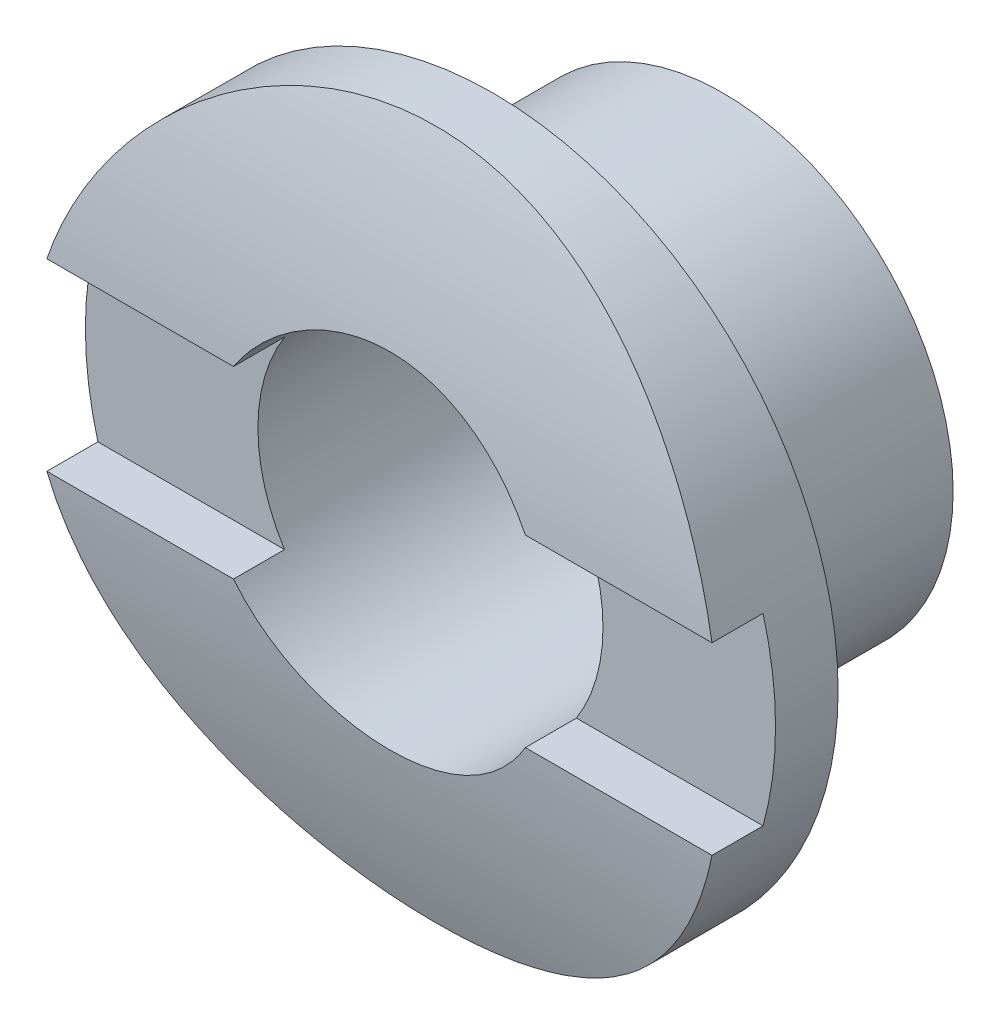
ISO-10303-21;
HEADER;
FILE_DESCRIPTION(('STEP AP214'),'2;1');
FILE_NAME('part.step','',(''),(''),'','','');
FILE_SCHEMA(('AUTOMOTIVE_DESIGN { 1 0 10303 214 1 1 1 1 }'));
ENDSEC;
DATA;
#1=APPLICATION_CONTEXT('core data for automotive mechanical design processes');
#2=APPLICATION_PROTOCOL_DEFINITION('international standard','automotive_design',2000,#1);
#3=PRODUCT_CONTEXT('',#1,'mechanical');
#4=PRODUCT('Part','Part','',(#3));
#5=PRODUCT_RELATED_PRODUCT_CATEGORY('part','',(#4));
#6=PRODUCT_DEFINITION_FORMATION('','',#4);
#7=PRODUCT_DEFINITION_CONTEXT('part definition',#1,'design');
#8=PRODUCT_DEFINITION('design','',#6,#7);
#9=PRODUCT_DEFINITION_SHAPE('','',#8);
#10=(LENGTH_UNIT() NAMED_UNIT(*) SI_UNIT(.MILLI.,.METRE.));
#11=(NAMED_UNIT(*) PLANE_ANGLE_UNIT() SI_UNIT($,.RADIAN.));
#12=(NAMED_UNIT(*) SI_UNIT($,.STERADIAN.) SOLID_ANGLE_UNIT());
#13=UNCERTAINTY_MEASURE_WITH_UNIT(LENGTH_MEASURE(1.E-05),#10,'distance_accuracy_value','');
#14=(GEOMETRIC_REPRESENTATION_CONTEXT(3) GLOBAL_UNCERTAINTY_ASSIGNED_CONTEXT((#13)) GLOBAL_UNIT_ASSIGNED_CONTEXT((#10,
#11,#12)) REPRESENTATION_CONTEXT('',''));
#15=CARTESIAN_POINT('',(0.,0.,0.));
#16=DIRECTION('',(0.,0.,1.));
#17=DIRECTION('',(1.,0.,0.));
#18=AXIS2_PLACEMENT_3D('',#15,#16,#17);
#19=CARTESIAN_POINT('',(-4.7625,0.,-9.1694));
#20=DIRECTION('',(1.,0.,0.));
#21=DIRECTION('',(0.,0.,-1.));
#22=AXIS2_PLACEMENT_3D('',#19,#20,#21);
#23=CYLINDRICAL_SURFACE('',#22,13.97);
#24=DIRECTION('',(1.,0.,0.));
#25=VECTOR('',#24,1.);
#26=CARTESIAN_POINT('',(-4.7625,1.27,4.74275296063122));
#27=LINE('',#26,#25);
#28=CARTESIAN_POINT('',(4.5900442535993,1.27,4.74275296063122));
#29=VERTEX_POINT('',#28);
#30=CARTESIAN_POINT('',(2.01431168454636,1.27,4.74275296063122));
#31=VERTEX_POINT('',#30);
#32=EDGE_CURVE('E208',#29,#31,#27,.F.);
#33=ORIENTED_EDGE('',*,*,#32,.F.);
#34=CARTESIAN_POINT('',(-4.7625,0.,4.8006));
#35=CARTESIAN_POINT('',(-4.76250242972162,-0.259520209301479,4.80060162437254));
#36=CARTESIAN_POINT('',(-4.74121856630326,-0.519023531451805,4.79330229947926));
#37=CARTESIAN_POINT('',(-4.65692038417852,-1.03036643531674,4.76490454247333));
#38=CARTESIAN_POINT('',(-4.59390361486468,-1.28220556607223,4.74380530001347));
#39=CARTESIAN_POINT('',(-4.42856486959527,-1.77077454306027,4.69009554815323));
#40=CARTESIAN_POINT('',(-4.32631039989946,-2.00752952945369,4.65750481698245));
#41=CARTESIAN_POINT('',(-4.08571070050257,-2.46052664995932,4.58412436775375));
#42=CARTESIAN_POINT('',(-3.94735785029565,-2.67676443965355,4.54333291891079));
#43=CARTESIAN_POINT('',(-3.63325865423897,-3.09037933447375,4.45618635823786));
#44=CARTESIAN_POINT('',(-3.45644382064466,-3.28691583748319,4.40969358160123));
#45=CARTESIAN_POINT('',(-3.07271062116619,-3.64819535740629,4.31712728228522));
#46=CARTESIAN_POINT('',(-2.86578523124806,-3.81293093504638,4.27105386010263));
#47=CARTESIAN_POINT('',(-2.42002582545019,-4.1108237748006,4.18301341432772));
#48=CARTESIAN_POINT('',(-2.18041450624162,-4.24287201003676,4.14121327381803));
#49=CARTESIAN_POINT('',(-1.68073043051258,-4.46443439413731,4.06855382922192));
#50=CARTESIAN_POINT('',(-1.42066427858192,-4.55396220709046,4.03769101119842));
#51=CARTESIAN_POINT('',(-0.89703578439561,-4.68475981699256,3.99185398703852));
#52=CARTESIAN_POINT('',(-0.63391506255327,-4.72761027406611,3.97636106105719));
#53=CARTESIAN_POINT('',(-0.103797405078318,-4.76877879480704,3.96148626356108));
#54=CARTESIAN_POINT('',(0.16319823838052,-4.76711137768898,3.96209913924301));
#55=CARTESIAN_POINT('',(0.679844283951734,-4.72051544575698,3.9789133810439));
#56=CARTESIAN_POINT('',(0.929711382957988,-4.67767105068513,3.99436373788502));
#57=CARTESIAN_POINT('',(1.41847190934876,-4.55334515720639,4.03787984704812));
#58=CARTESIAN_POINT('',(1.65736396197189,-4.47185883281211,4.06594717507978));
#59=CARTESIAN_POINT('',(2.12204227074593,-4.27123739558592,4.13205499140205));
#60=CARTESIAN_POINT('',(2.34754435170177,-4.151498455885,4.17025363921176));
#61=CARTESIAN_POINT('',(2.77590444828291,-3.8781900448024,4.25225616729703));
#62=CARTESIAN_POINT('',(2.97875565791859,-3.72461044618995,4.29606172386034));
#63=CARTESIAN_POINT('',(3.36773812930072,-3.37805330727057,4.38727460262429));
#64=CARTESIAN_POINT('',(3.55234510865294,-3.18337862669136,4.43474778684322));
#65=CARTESIAN_POINT('',(3.88669967496496,-2.76525463717983,4.52585444618878));
#66=CARTESIAN_POINT('',(4.03644360388587,-2.54180231254277,4.56948751808948));
#67=CARTESIAN_POINT('',(4.29812449329664,-2.06912029511437,4.64861719856937));
#68=CARTESIAN_POINT('',(4.40963594472786,-1.81963840925927,4.68402090422643));
#69=CARTESIAN_POINT('',(4.58862862333098,-1.3039588456075,4.74202630047948));
#70=CARTESIAN_POINT('',(4.65612587975642,-1.03776729196089,4.76463265126789));
#71=CARTESIAN_POINT('',(4.74243407450553,-0.509115739509426,4.79371594787633));
#72=CARTESIAN_POINT('',(4.76330341176758,-0.247028853437725,4.80087432717599));
#73=CARTESIAN_POINT('',(4.76164954572772,0.276964905012603,4.80030963571936));
#74=CARTESIAN_POINT('',(4.73913405031038,0.538871801099043,4.79258920837819));
#75=CARTESIAN_POINT('',(4.65296839291333,1.04671898836614,4.76358451354175));
#76=CARTESIAN_POINT('',(4.59059636146567,1.29290262055371,4.74272197632451));
#77=CARTESIAN_POINT('',(4.4281007987633,1.77120027243205,4.68995392038644));
#78=CARTESIAN_POINT('',(4.32797241572167,2.0033124794575,4.65804698247535));
#79=CARTESIAN_POINT('',(4.08982504966704,2.4538567281058,4.58534440563403));
#80=CARTESIAN_POINT('',(3.95085771890072,2.67175157041495,4.54433240804303));
#81=CARTESIAN_POINT('',(3.64008324895307,3.08178996925755,4.45805190793812));
#82=CARTESIAN_POINT('',(3.46826567871894,3.27392531322984,4.41278205573857));
#83=CARTESIAN_POINT('',(3.08699574743885,3.63652479170279,4.32034729722657));
#84=CARTESIAN_POINT('',(2.87614049926419,3.80552060010488,4.27319484424977));
#85=CARTESIAN_POINT('',(2.42806209884457,4.10593058142955,4.18450754331621));
#86=CARTESIAN_POINT('',(2.19083842955086,4.2373440172325,4.14297280555059));
#87=CARTESIAN_POINT('',(1.69638670595092,4.45835066029313,4.07059985495048));
#88=CARTESIAN_POINT('',(1.43918228246899,4.54799241733209,4.03974923510292));
#89=CARTESIAN_POINT('',(0.912024177520425,4.68225423459899,3.99276371377574));
#90=CARTESIAN_POINT('',(0.642076657562161,4.72689582443987,3.97662177551721));
#91=CARTESIAN_POINT('',(0.112686336071423,4.76816441712213,3.9617058279076));
#92=CARTESIAN_POINT('',(-0.146542682780967,4.76723976356484,3.96204618198739));
#93=CARTESIAN_POINT('',(-0.660943293613602,4.72347103169564,3.9778525796015));
#94=CARTESIAN_POINT('',(-0.916115147710293,4.68062967272187,3.99331764192328));
#95=CARTESIAN_POINT('',(-1.4098568555459,4.55600965691376,4.03695703107885));
#96=CARTESIAN_POINT('',(-1.64866159559816,4.4750591741216,4.06486039856239));
#97=CARTESIAN_POINT('',(-2.10947725586448,4.27719867110049,4.13012151477151));
#98=CARTESIAN_POINT('',(-2.33148432917702,4.16028044462357,4.1674814207158));
#99=CARTESIAN_POINT('',(-2.76330166318667,3.88763285439733,4.24955394184217));
#100=CARTESIAN_POINT('',(-2.97210480902922,3.73038612836333,4.29452284854716));
#101=CARTESIAN_POINT('',(-3.3611498451733,3.38407172189302,4.38570913768456));
#102=CARTESIAN_POINT('',(-3.54138345790059,3.19499485177196,4.43192687742343));
#103=CARTESIAN_POINT('',(-3.87572403200371,2.78097835198109,4.52270478457953));
#104=CARTESIAN_POINT('',(-4.02843744211141,2.55487660157062,4.56711671292697));
#105=CARTESIAN_POINT('',(-4.29354136605175,2.07872822983415,4.64718304588737));
#106=CARTESIAN_POINT('',(-4.40593999287707,1.82868643907527,4.68283921206385));
#107=CARTESIAN_POINT('',(-4.58382996729025,1.31928548829034,4.74045606317055));
#108=CARTESIAN_POINT('',(-4.65060810809615,1.06041929369418,4.76278997775228));
#109=CARTESIAN_POINT('',(-4.73993504610888,0.534361035923562,4.79285885641577));
#110=CARTESIAN_POINT('',(-4.7624974986436,0.26717156916776,4.80059832773655));
#111=CARTESIAN_POINT('',(-4.7625,0.,4.8006));
#112=B_SPLINE_CURVE_WITH_KNOTS('',3,(#34,#35,#36,#37,#38,#39,#40,#41,#42,#43,#44,#45,#46,#47,
#48,#49,#50,#51,#52,#53,#54,#55,#56,#57,#58,#59,#60,#61,#62,#63,#64,#65,#66,#67,#68,#69,#70,#71,
#72,#73,#74,#75,#76,#77,#78,#79,#80,#81,#82,#83,#84,#85,#86,#87,#88,#89,#90,#91,#92,#93,#94,#95,
#96,#97,#98,#99,#100,#101,#102,#103,#104,#105,#106,#107,#108,#109,#110,#111),.UNSPECIFIED.,.T.,
.F.,(4,2,2,2,2,2,2,2,2,2,2,2,2,2,2,2,2,2,2,2,2,2,2,2,2,2,2,2,2,2,2,2,2,2,2,2,2,2,4),(0.,
0.777577034989034,1.55519973430527,2.33149053266644,3.1079453417551,3.9096167353001,
4.7114754392695,5.53764901726038,6.36355692149753,7.16053245581212,7.95724806492593,
8.71565260376265,9.47415188463484,10.2452707209132,11.0166206381023,11.830217931898,
12.643900554733,13.4663655505365,14.2885308504419,15.0736177288829,15.8585651392029,
16.6195240471403,17.3805807735689,18.162146095194,18.9439600034321,19.7630164978037,
20.5820890555897,21.4002072444376,22.2179338316343,22.991773232902,23.7655624348175,
24.5232616982522,25.281133963513,26.0733148684647,26.8657248775353,27.6909984507599,
28.5161058516901,29.3168553053063,30.1173574209065),.UNSPECIFIED.);
#113=CARTESIAN_POINT('',(-4.59004425359931,1.27,4.74275296063122));
#114=VERTEX_POINT('',#113);
#115=EDGE_CURVE('E178',#29,#114,#112,.T.);
#116=ORIENTED_EDGE('',*,*,#115,.T.);
#117=CARTESIAN_POINT('',(-2.01431168454636,1.27,4.74275296063122));
#118=VERTEX_POINT('',#117);
#119=EDGE_CURVE('E213',#118,#114,#27,.F.);
#120=ORIENTED_EDGE('',*,*,#119,.F.);
#121=CARTESIAN_POINT('',(-2.38125,0.,4.8006));
#122=CARTESIAN_POINT('',(-2.38124471839167,-0.132725007365576,4.80059769749034));
#123=CARTESIAN_POINT('',(-2.37011586440644,-0.265521336892324,4.79868885367673));
#124=CARTESIAN_POINT('',(-2.32591475604167,-0.527386417109863,4.79125793835553));
#125=CARTESIAN_POINT('',(-2.29282261074633,-0.656451678111296,4.78573259164771));
#126=CARTESIAN_POINT('',(-2.20572565322494,-0.907028346183606,4.77168812399769));
#127=CARTESIAN_POINT('',(-2.15173825878362,-1.02854594715733,4.76317149706147));
#128=CARTESIAN_POINT('',(-2.02442959880127,-1.2607832721763,4.74407977994721));
#129=CARTESIAN_POINT('',(-1.95111043132453,-1.37150416619571,4.73350491318112));
#130=CARTESIAN_POINT('',(-1.78644136011456,-1.58012491505757,4.71135011888971));
#131=CARTESIAN_POINT('',(-1.69493621669052,-1.67790138482896,4.69976205594693));
#132=CARTESIAN_POINT('',(-1.49682680489367,-1.85679168023782,4.67694885312624));
#133=CARTESIAN_POINT('',(-1.39022156234545,-1.93790442999572,4.66572373672106));
#134=CARTESIAN_POINT('',(-1.1640862366184,-2.08166254045497,4.64482854936155));
#135=CARTESIAN_POINT('',(-1.04447714439176,-2.14418527873576,4.6351689870525));
#136=CARTESIAN_POINT('',(-0.796261888970042,-2.2482042829411,4.6186117904269));
#137=CARTESIAN_POINT('',(-0.667656363010044,-2.28970203639387,4.61171396072363));
#138=CARTESIAN_POINT('',(-0.406409003581763,-2.35010308014487,4.60154237602486));
#139=CARTESIAN_POINT('',(-0.27381786655329,-2.36921977308396,4.59823441432099));
#140=CARTESIAN_POINT('',(-0.0072718367016254,-2.38497782788982,4.5955136918983));
#141=CARTESIAN_POINT('',(0.126682954440815,-2.38162085342345,4.59610064284925));
#142=CARTESIAN_POINT('',(0.390626522305667,-2.35270055265497,4.60107221134395));
#143=CARTESIAN_POINT('',(0.52064250808028,-2.32737745862684,4.60541574355423));
#144=CARTESIAN_POINT('',(0.774553044110415,-2.25562098472067,4.61734671755111));
#145=CARTESIAN_POINT('',(0.898447375457813,-2.20918685052438,4.62493427524935));
#146=CARTESIAN_POINT('',(1.13731404913435,-2.096284334028,4.64254250727464));
#147=CARTESIAN_POINT('',(1.25223854546518,-2.02971667426804,4.65257518966506));
#148=CARTESIAN_POINT('',(1.46937728841987,-1.87850715546196,4.67393497495906));
#149=CARTESIAN_POINT('',(1.5715904620058,-1.7938637721737,4.68526218698687));
#150=CARTESIAN_POINT('',(1.76179524175952,-1.60759898630003,4.7081150090901));
#151=CARTESIAN_POINT('',(1.84958515233528,-1.50577157600301,4.71964128664582));
#152=CARTESIAN_POINT('',(2.00686359000834,-1.28872468409117,4.7414578257289));
#153=CARTESIAN_POINT('',(2.0763519889063,-1.1735051086744,4.75174807859781));
#154=CARTESIAN_POINT('',(2.19507519148637,-0.932751310532352,4.76994875610055));
#155=CARTESIAN_POINT('',(2.24429163049266,-0.807207858200267,4.7778570211205));
#156=CARTESIAN_POINT('',(2.32088377044362,-0.549471842145763,4.79038546274587));
#157=CARTESIAN_POINT('',(2.34826138355782,-0.417279861634555,4.79500592722154));
#158=CARTESIAN_POINT('',(2.38012403203758,-0.151737107702495,4.80039931317885));
#159=CARTESIAN_POINT('',(2.38488586010219,-0.018420459024662,4.80121875217805));
#160=CARTESIAN_POINT('',(2.37212049263335,0.247105417282439,4.79904535508874));
#161=CARTESIAN_POINT('',(2.35459419555175,0.379314689334685,4.79605267266985));
#162=CARTESIAN_POINT('',(2.29798029764278,0.638013927217626,4.78662012171256));
#163=CARTESIAN_POINT('',(2.25903025674797,0.764534868310413,4.78020225371106));
#164=CARTESIAN_POINT('',(2.16082154727616,1.00925099271682,4.76463602618565));
#165=CARTESIAN_POINT('',(2.10156169512358,1.12744569032581,4.75548750753421));
#166=CARTESIAN_POINT('',(1.96378529954236,1.35335287828996,4.73535927144547));
#167=CARTESIAN_POINT('',(1.885096508018,1.46095885706583,4.72436347194689));
#168=CARTESIAN_POINT('',(1.7109321876142,1.66153755935757,4.70180755520999));
#169=CARTESIAN_POINT('',(1.61545537973021,1.75450916692204,4.69024739502403));
#170=CARTESIAN_POINT('',(1.40918175421953,1.92421051392722,4.66771455983326));
#171=CARTESIAN_POINT('',(1.29822982191506,2.00075290182718,4.65674962830986));
#172=CARTESIAN_POINT('',(1.06488032610596,2.13411307888503,4.63679524754578));
#173=CARTESIAN_POINT('',(0.942483137467966,2.1909315137748,4.62780573363651));
#174=CARTESIAN_POINT('',(0.69023300291278,2.28295321905759,4.61287858546417));
#175=CARTESIAN_POINT('',(0.560414410032646,2.31824845896057,4.60692798379243));
#176=CARTESIAN_POINT('',(0.296580919922009,2.36651036675213,4.59872036411221));
#177=CARTESIAN_POINT('',(0.162566407130186,2.3794790741827,4.59646300872442));
#178=CARTESIAN_POINT('',(-0.1039829576455,2.38266091182428,4.5959124623079));
#179=CARTESIAN_POINT('',(-0.23651427399851,2.37316904010505,4.59756788044428));
#180=CARTESIAN_POINT('',(-0.498064354023103,2.33233842341708,4.60454349786237));
#181=CARTESIAN_POINT('',(-0.627083130612455,2.30099975880371,4.60986368366458));
#182=CARTESIAN_POINT('',(-0.877823921417657,2.21748018884171,4.62354948471676));
#183=CARTESIAN_POINT('',(-0.999555001329163,2.16532582440537,4.63191122066091));
#184=CARTESIAN_POINT('',(-1.2325870858052,2.04168593611325,4.65074153019558));
#185=CARTESIAN_POINT('',(-1.3438875337991,1.97019938149637,4.66121021611767));
#186=CARTESIAN_POINT('',(-1.55438720152797,1.80887623036405,4.68323721026111));
#187=CARTESIAN_POINT('',(-1.65341917352763,1.71882299704501,4.69480742454253));
#188=CARTESIAN_POINT('',(-1.8350666807798,1.5233788311236,4.71763988609665));
#189=CARTESIAN_POINT('',(-1.91767842688546,1.4179843680622,4.7289020617702));
#190=CARTESIAN_POINT('',(-2.06469076682566,1.19393884138798,4.74994445341283));
#191=CARTESIAN_POINT('',(-2.12895484073521,1.07519711852437,4.75971332076254));
#192=CARTESIAN_POINT('',(-2.23652407368211,0.828483566880472,4.7765579791294));
#193=CARTESIAN_POINT('',(-2.27984990251408,0.700520984766011,4.783636424594));
#194=CARTESIAN_POINT('',(-2.33501321476972,0.476734283128501,4.79277546798021));
#195=CARTESIAN_POINT('',(-2.35232392316153,0.382256585659958,4.79569383202271));
#196=CARTESIAN_POINT('',(-2.37544411847791,0.191864999432056,4.79960691251199));
#197=CARTESIAN_POINT('',(-2.38125381824297,0.0959511372838119,4.80060166455761));
#198=CARTESIAN_POINT('',(-2.38125,0.,4.8006));
#199=B_SPLINE_CURVE_WITH_KNOTS('',3,(#121,#122,#123,#124,#125,#126,#127,#128,#129,#130,#131,
#132,#133,#134,#135,#136,#137,#138,#139,#140,#141,#142,#143,#144,#145,#146,#147,#148,#149,#150,
#151,#152,#153,#154,#155,#156,#157,#158,#159,#160,#161,#162,#163,#164,#165,#166,#167,#168,#169,
#170,#171,#172,#173,#174,#175,#176,#177,#178,#179,#180,#181,#182,#183,#184,#185,#186,#187,#188,
#189,#190,#191,#192,#193,#194,#195,#196,#197,#198),.UNSPECIFIED.,.T.,.F.,(4,2,2,2,2,2,2,2,2,2,2,
2,2,2,2,2,2,2,2,2,2,2,2,2,2,2,2,2,2,2,2,2,2,2,2,2,2,2,4),(0.,0.39782426397441,0.796009307499102,
1.19386314579007,1.59167382303252,1.99303866367444,2.39442940997367,2.79841186778348,
3.20236573963922,3.60243571972037,4.002476083994,4.39819579476623,4.79392964610447,
5.19164756749806,5.58939903985637,5.99231046782883,6.39522471806007,6.79850317585974,
7.20174631942362,7.60004126041271,7.9983201463285,8.3940710775158,8.78984507542679,
9.18926242266232,9.5887102129302,9.99249600223523,10.3962685709678,10.7983034866122,
11.2003016741794,11.5970493669356,11.9937956004093,12.3900375732403,12.7863006772192,
13.1874795486554,13.5887508893009,13.9929344818975,14.3967182537655,14.6843234139344,
14.9719232515619),.UNSPECIFIED.);
#200=EDGE_CURVE('E152',#31,#118,#199,.T.);
#201=ORIENTED_EDGE('',*,*,#200,.F.);
#202=EDGE_LOOP('',(#33,#116,#120,#201));
#203=FACE_BOUND('',#202,.T.);
#204=ADVANCED_FACE('F38',(#203),#23,.T.);
#205=CARTESIAN_POINT('',(0.,0.,3.175));
#206=DIRECTION('',(0.,0.,-1.));
#207=DIRECTION('',(-1.,0.,0.));
#208=AXIS2_PLACEMENT_3D('',#205,#206,#207);
#209=CYLINDRICAL_SURFACE('',#208,2.38125);
#210=DIRECTION('',(0.,0.,-1.));
#211=VECTOR('',#210,1.);
#212=CARTESIAN_POINT('',(-2.01431168454636,1.27,3.175));
#213=LINE('',#212,#211);
#214=CARTESIAN_POINT('',(-2.01431168454636,1.27,4.0386));
#215=VERTEX_POINT('',#214);
#216=EDGE_CURVE('E138',#215,#118,#213,.F.);
#217=ORIENTED_EDGE('',*,*,#216,.F.);
#218=CARTESIAN_POINT('',(0.,0.,4.0386));
#219=DIRECTION('',(0.,0.,-1.));
#220=DIRECTION('',(-1.,0.,0.));
#221=AXIS2_PLACEMENT_3D('',#218,#219,#220);
#222=CIRCLE('',#221,2.38125);
#223=CARTESIAN_POINT('',(-2.01431168454636,-1.27,4.0386));
#224=VERTEX_POINT('',#223);
#225=EDGE_CURVE('E148',#224,#215,#222,.T.);
#226=ORIENTED_EDGE('',*,*,#225,.F.);
#227=DIRECTION('',(0.,0.,-1.));
#228=VECTOR('',#227,1.);
#229=CARTESIAN_POINT('',(-2.01431168454636,-1.27,3.175));
#230=LINE('',#229,#228);
#231=CARTESIAN_POINT('',(-2.01431168454636,-1.27,4.74275296063122));
#232=VERTEX_POINT('',#231);
#233=EDGE_CURVE('E115',#232,#224,#230,.T.);
#234=ORIENTED_EDGE('',*,*,#233,.F.);
#235=CARTESIAN_POINT('',(2.01431168454636,-1.27,4.74275296063122));
#236=VERTEX_POINT('',#235);
#237=EDGE_CURVE('E161',#232,#236,#199,.T.);
#238=ORIENTED_EDGE('',*,*,#237,.T.);
#239=DIRECTION('',(0.,0.,-1.));
#240=VECTOR('',#239,1.);
#241=CARTESIAN_POINT('',(2.01431168454636,-1.27,3.175));
#242=LINE('',#241,#240);
#243=CARTESIAN_POINT('',(2.01431168454636,-1.27,4.0386));
#244=VERTEX_POINT('',#243);
#245=EDGE_CURVE('E62',#244,#236,#242,.F.);
#246=ORIENTED_EDGE('',*,*,#245,.F.);
#247=CARTESIAN_POINT('',(2.01431168454636,1.27,4.0386));
#248=VERTEX_POINT('',#247);
#249=EDGE_CURVE('E151',#248,#244,#222,.T.);
#250=ORIENTED_EDGE('',*,*,#249,.F.);
#251=DIRECTION('',(0.,0.,-1.));
#252=VECTOR('',#251,1.);
#253=CARTESIAN_POINT('',(2.01431168454636,1.27,3.175));
#254=LINE('',#253,#252);
#255=EDGE_CURVE('E145',#31,#248,#254,.T.);
#256=ORIENTED_EDGE('',*,*,#255,.F.);
#257=ORIENTED_EDGE('',*,*,#200,.T.);
#258=EDGE_LOOP('',(#217,#226,#234,#238,#246,#250,#256,#257));
#259=FACE_BOUND('',#258,.T.);
#260=CARTESIAN_POINT('',(0.,0.,0.));
#261=DIRECTION('',(0.,0.,1.));
#262=DIRECTION('',(1.,0.,0.));
#263=AXIS2_PLACEMENT_3D('',#260,#261,#262);
#264=CIRCLE('',#263,2.38125);
#265=CARTESIAN_POINT('',(2.38125,0.,0.));
#266=VERTEX_POINT('',#265);
#267=EDGE_CURVE('E227',#266,#266,#264,.T.);
#268=ORIENTED_EDGE('',*,*,#267,.F.);
#269=EDGE_LOOP('',(#268));
#270=FACE_BOUND('',#269,.T.);
#271=ADVANCED_FACE('F164',(#259,#270),#209,.F.);
#272=CARTESIAN_POINT('',(0.,0.,4.8006));
#273=DIRECTION('',(0.,0.,-1.));
#274=DIRECTION('',(-1.,0.,0.));
#275=AXIS2_PLACEMENT_3D('',#272,#273,#274);
#276=CYLINDRICAL_SURFACE('',#275,4.7625);
#277=CARTESIAN_POINT('',(0.,0.,3.175));
#278=DIRECTION('',(0.,0.,1.));
#279=DIRECTION('',(1.,0.,0.));
#280=AXIS2_PLACEMENT_3D('',#277,#278,#279);
#281=CIRCLE('',#280,4.7625);
#282=CARTESIAN_POINT('',(4.7625,0.,3.175));
#283=VERTEX_POINT('',#282);
#284=EDGE_CURVE('E162',#283,#283,#281,.T.);
#285=ORIENTED_EDGE('',*,*,#284,.T.);
#286=EDGE_LOOP('',(#285));
#287=FACE_BOUND('',#286,.T.);
#288=ORIENTED_EDGE('',*,*,#115,.F.);
#289=DIRECTION('',(0.,0.,-1.));
#290=VECTOR('',#289,1.);
#291=CARTESIAN_POINT('',(4.5900442535993,1.27,4.8006));
#292=LINE('',#291,#290);
#293=CARTESIAN_POINT('',(4.5900442535993,1.27,4.0386));
#294=VERTEX_POINT('',#293);
#295=EDGE_CURVE('E141',#29,#294,#292,.T.);
#296=ORIENTED_EDGE('',*,*,#295,.T.);
#297=CARTESIAN_POINT('',(0.,0.,4.0386));
#298=DIRECTION('',(0.,0.,-1.));
#299=DIRECTION('',(-1.,0.,0.));
#300=AXIS2_PLACEMENT_3D('',#297,#298,#299);
#301=CIRCLE('',#300,4.7625);
#302=CARTESIAN_POINT('',(4.5900442535993,-1.27,4.0386));
#303=VERTEX_POINT('',#302);
#304=EDGE_CURVE('E42',#294,#303,#301,.T.);
#305=ORIENTED_EDGE('',*,*,#304,.T.);
#306=DIRECTION('',(0.,0.,-1.));
#307=VECTOR('',#306,1.);
#308=CARTESIAN_POINT('',(4.5900442535993,-1.27,4.8006));
#309=LINE('',#308,#307);
#310=CARTESIAN_POINT('',(4.5900442535993,-1.27,4.74275296063122));
#311=VERTEX_POINT('',#310);
#312=EDGE_CURVE('E132',#303,#311,#309,.F.);
#313=ORIENTED_EDGE('',*,*,#312,.T.);
#314=CARTESIAN_POINT('',(-4.59004425359948,-1.27000000000008,4.74275296063127));
#315=VERTEX_POINT('',#314);
#316=EDGE_CURVE('E125',#315,#311,#112,.T.);
#317=ORIENTED_EDGE('',*,*,#316,.F.);
#318=DIRECTION('',(0.,0.,-1.));
#319=VECTOR('',#318,1.);
#320=CARTESIAN_POINT('',(-4.5900442535993,-1.27,4.8006));
#321=LINE('',#320,#319);
#322=CARTESIAN_POINT('',(-4.5900442535993,-1.27,4.0386));
#323=VERTEX_POINT('',#322);
#324=EDGE_CURVE('E54',#315,#323,#321,.T.);
#325=ORIENTED_EDGE('',*,*,#324,.T.);
#326=CARTESIAN_POINT('',(-4.5900442535993,1.27,4.0386));
#327=VERTEX_POINT('',#326);
#328=EDGE_CURVE('E11',#323,#327,#301,.T.);
#329=ORIENTED_EDGE('',*,*,#328,.T.);
#330=DIRECTION('',(0.,0.,-1.));
#331=VECTOR('',#330,1.);
#332=CARTESIAN_POINT('',(-4.5900442535993,1.27,4.8006));
#333=LINE('',#332,#331);
#334=EDGE_CURVE('E130',#327,#114,#333,.F.);
#335=ORIENTED_EDGE('',*,*,#334,.T.);
#336=EDGE_LOOP('',(#288,#296,#305,#313,#317,#325,#329,#335));
#337=FACE_BOUND('',#336,.T.);
#338=ADVANCED_FACE('F122',(#287,#337),#276,.T.);
#339=CARTESIAN_POINT('',(0.,0.,0.));
#340=DIRECTION('',(0.,0.,1.));
#341=DIRECTION('',(1.,0.,0.));
#342=AXIS2_PLACEMENT_3D('',#339,#340,#341);
#343=PLANE('',#342);
#344=CARTESIAN_POINT('',(0.,0.,0.));
#345=DIRECTION('',(0.,0.,1.));
#346=DIRECTION('',(1.,0.,0.));
#347=AXIS2_PLACEMENT_3D('',#344,#345,#346);
#348=CIRCLE('',#347,3.175);
#349=CARTESIAN_POINT('',(3.175,0.,0.));
#350=VERTEX_POINT('',#349);
#351=EDGE_CURVE('E187',#350,#350,#348,.T.);
#352=ORIENTED_EDGE('',*,*,#351,.F.);
#353=EDGE_LOOP('',(#352));
#354=FACE_BOUND('',#353,.T.);
#355=ORIENTED_EDGE('',*,*,#267,.T.);
#356=EDGE_LOOP('',(#355));
#357=FACE_BOUND('',#356,.T.);
#358=ADVANCED_FACE('F192',(#354,#357),#343,.F.);
#359=CARTESIAN_POINT('',(0.,0.,3.175));
#360=DIRECTION('',(0.,0.,-1.));
#361=DIRECTION('',(-1.,0.,0.));
#362=AXIS2_PLACEMENT_3D('',#359,#360,#361);
#363=CYLINDRICAL_SURFACE('',#362,3.175);
#364=CARTESIAN_POINT('',(0.,0.,3.175));
#365=DIRECTION('',(0.,0.,1.));
#366=DIRECTION('',(1.,0.,0.));
#367=AXIS2_PLACEMENT_3D('',#364,#365,#366);
#368=CIRCLE('',#367,3.175);
#369=CARTESIAN_POINT('',(3.175,0.,3.175));
#370=VERTEX_POINT('',#369);
#371=EDGE_CURVE('E186',#370,#370,#368,.T.);
#372=ORIENTED_EDGE('',*,*,#371,.F.);
#373=EDGE_LOOP('',(#372));
#374=FACE_BOUND('',#373,.T.);
#375=ORIENTED_EDGE('',*,*,#351,.T.);
#376=EDGE_LOOP('',(#375));
#377=FACE_BOUND('',#376,.T.);
#378=ADVANCED_FACE('F40',(#374,#377),#363,.T.);
#379=CARTESIAN_POINT('',(0.,0.,3.175));
#380=DIRECTION('',(0.,0.,1.));
#381=DIRECTION('',(1.,0.,0.));
#382=AXIS2_PLACEMENT_3D('',#379,#380,#381);
#383=PLANE('',#382);
#384=ORIENTED_EDGE('',*,*,#371,.T.);
#385=EDGE_LOOP('',(#384));
#386=FACE_BOUND('',#385,.T.);
#387=ORIENTED_EDGE('',*,*,#284,.F.);
#388=EDGE_LOOP('',(#387));
#389=FACE_BOUND('',#388,.T.);
#390=ADVANCED_FACE('F173',(#386,#389),#383,.F.);
#391=DIRECTION('',(1.,0.,0.));
#392=VECTOR('',#391,1.);
#393=CARTESIAN_POINT('',(-4.7625,-1.27,4.74275296063122));
#394=LINE('',#393,#392);
#395=EDGE_CURVE('E219',#315,#232,#394,.T.);
#396=ORIENTED_EDGE('',*,*,#395,.F.);
#397=ORIENTED_EDGE('',*,*,#316,.T.);
#398=EDGE_CURVE('E189',#236,#311,#394,.T.);
#399=ORIENTED_EDGE('',*,*,#398,.F.);
#400=ORIENTED_EDGE('',*,*,#237,.F.);
#401=EDGE_LOOP('',(#396,#397,#399,#400));
#402=FACE_BOUND('',#401,.T.);
#403=ADVANCED_FACE('F167',(#402),#23,.T.);
#404=CARTESIAN_POINT('',(-4.7625,-1.27,4.8006));
#405=DIRECTION('',(0.,-1.,0.));
#406=DIRECTION('',(0.,0.,-1.));
#407=AXIS2_PLACEMENT_3D('',#404,#405,#406);
#408=PLANE('',#407);
#409=ORIENTED_EDGE('',*,*,#245,.T.);
#410=ORIENTED_EDGE('',*,*,#398,.T.);
#411=ORIENTED_EDGE('',*,*,#312,.F.);
#412=DIRECTION('',(1.,0.,0.));
#413=VECTOR('',#412,1.);
#414=CARTESIAN_POINT('',(-4.7625,-1.27,4.0386));
#415=LINE('',#414,#413);
#416=EDGE_CURVE('E118',#244,#303,#415,.T.);
#417=ORIENTED_EDGE('',*,*,#416,.F.);
#418=EDGE_LOOP('',(#409,#410,#411,#417));
#419=FACE_BOUND('',#418,.T.);
#420=ADVANCED_FACE('F172',(#419),#408,.F.);
#421=CARTESIAN_POINT('',(-4.7625,1.27,4.8006));
#422=DIRECTION('',(0.,1.,0.));
#423=DIRECTION('',(0.,0.,1.));
#424=AXIS2_PLACEMENT_3D('',#421,#422,#423);
#425=PLANE('',#424);
#426=ORIENTED_EDGE('',*,*,#255,.T.);
#427=DIRECTION('',(1.,0.,0.));
#428=VECTOR('',#427,1.);
#429=CARTESIAN_POINT('',(-4.7625,1.27,4.0386));
#430=LINE('',#429,#428);
#431=EDGE_CURVE('E117',#248,#294,#430,.T.);
#432=ORIENTED_EDGE('',*,*,#431,.T.);
#433=ORIENTED_EDGE('',*,*,#295,.F.);
#434=ORIENTED_EDGE('',*,*,#32,.T.);
#435=EDGE_LOOP('',(#426,#432,#433,#434));
#436=FACE_BOUND('',#435,.T.);
#437=ADVANCED_FACE('F266',(#436),#425,.F.);
#438=CARTESIAN_POINT('',(-4.7625,1.27,4.0386));
#439=DIRECTION('',(0.,0.,-1.));
#440=DIRECTION('',(-1.,0.,0.));
#441=AXIS2_PLACEMENT_3D('',#438,#439,#440);
#442=PLANE('',#441);
#443=ORIENTED_EDGE('',*,*,#249,.T.);
#444=ORIENTED_EDGE('',*,*,#416,.T.);
#445=ORIENTED_EDGE('',*,*,#304,.F.);
#446=ORIENTED_EDGE('',*,*,#431,.F.);
#447=EDGE_LOOP('',(#443,#444,#445,#446));
#448=FACE_BOUND('',#447,.T.);
#449=ADVANCED_FACE('F271',(#448),#442,.F.);
#450=ORIENTED_EDGE('',*,*,#225,.T.);
#451=EDGE_CURVE('E109',#327,#215,#430,.T.);
#452=ORIENTED_EDGE('',*,*,#451,.F.);
#453=ORIENTED_EDGE('',*,*,#328,.F.);
#454=EDGE_CURVE('E106',#323,#224,#415,.T.);
#455=ORIENTED_EDGE('',*,*,#454,.T.);
#456=EDGE_LOOP('',(#450,#452,#453,#455));
#457=FACE_BOUND('',#456,.T.);
#458=ADVANCED_FACE('F105',(#457),#442,.F.);
#459=ORIENTED_EDGE('',*,*,#233,.T.);
#460=ORIENTED_EDGE('',*,*,#454,.F.);
#461=ORIENTED_EDGE('',*,*,#324,.F.);
#462=ORIENTED_EDGE('',*,*,#395,.T.);
#463=EDGE_LOOP('',(#459,#460,#461,#462));
#464=FACE_BOUND('',#463,.T.);
#465=ADVANCED_FACE('F113',(#464),#408,.F.);
#466=ORIENTED_EDGE('',*,*,#216,.T.);
#467=ORIENTED_EDGE('',*,*,#119,.T.);
#468=ORIENTED_EDGE('',*,*,#334,.F.);
#469=ORIENTED_EDGE('',*,*,#451,.T.);
#470=EDGE_LOOP('',(#466,#467,#468,#469));
#471=FACE_BOUND('',#470,.T.);
#472=ADVANCED_FACE('F216',(#471),#425,.F.);
#473=CLOSED_SHELL('',(#204,#271,#338,#358,#378,#390,#403,#420,#437,#449,#458,#465,#472));
#474=MANIFOLD_SOLID_BREP('B2',#473);
#475=ADVANCED_BREP_SHAPE_REPRESENTATION('',(#18,#474),#14);
#476=SHAPE_DEFINITION_REPRESENTATION(#9,#475);
ENDSEC;
END-ISO-10303-21;
